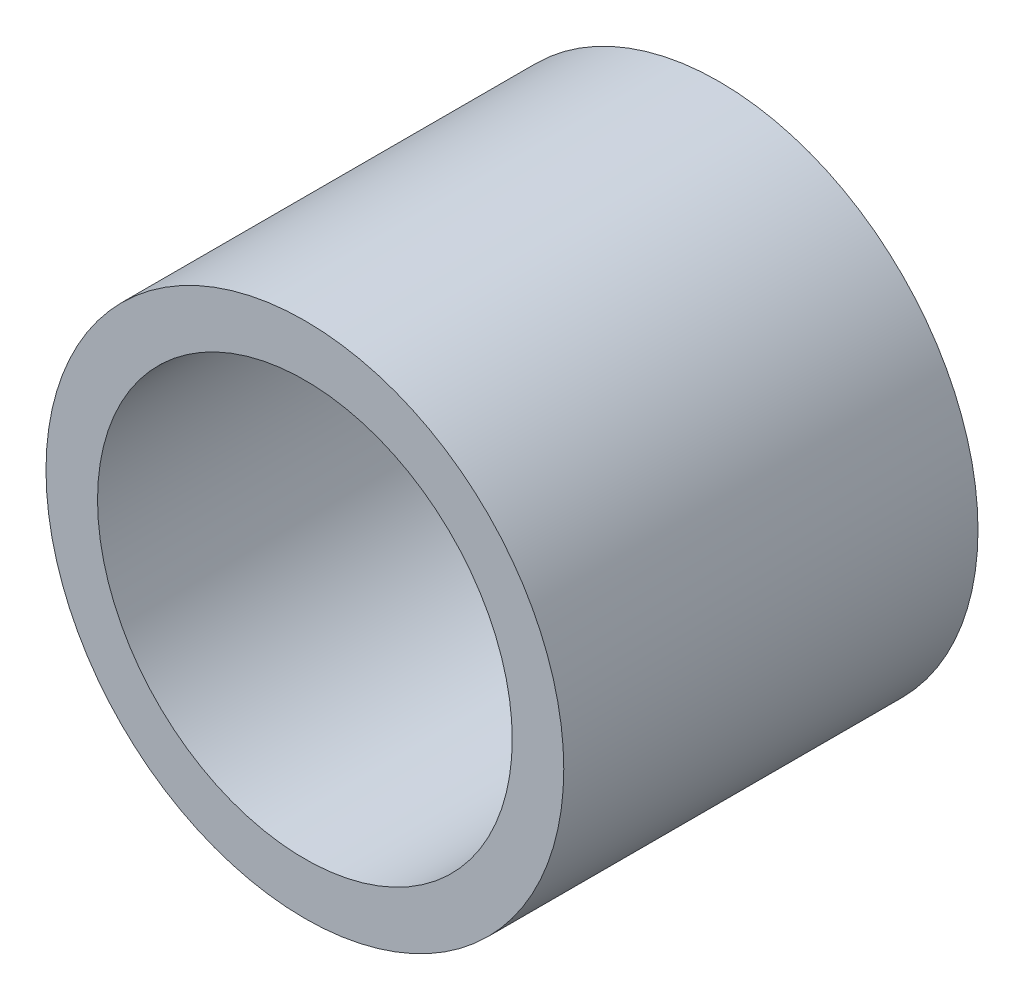
ISO-10303-21;
HEADER;
FILE_DESCRIPTION(('STEP AP214'),'2;1');
FILE_NAME('part.step','',(''),(''),'','','');
FILE_SCHEMA(('AUTOMOTIVE_DESIGN { 1 0 10303 214 1 1 1 1 }'));
ENDSEC;
DATA;
#1=APPLICATION_CONTEXT('core data for automotive mechanical design processes');
#2=APPLICATION_PROTOCOL_DEFINITION('international standard','automotive_design',2000,#1);
#3=PRODUCT_CONTEXT('',#1,'mechanical');
#4=PRODUCT('Part','Part','',(#3));
#5=PRODUCT_RELATED_PRODUCT_CATEGORY('part','',(#4));
#6=PRODUCT_DEFINITION_FORMATION('','',#4);
#7=PRODUCT_DEFINITION_CONTEXT('part definition',#1,'design');
#8=PRODUCT_DEFINITION('design','',#6,#7);
#9=PRODUCT_DEFINITION_SHAPE('','',#8);
#10=(LENGTH_UNIT() NAMED_UNIT(*) SI_UNIT(.MILLI.,.METRE.));
#11=(NAMED_UNIT(*) PLANE_ANGLE_UNIT() SI_UNIT($,.RADIAN.));
#12=(NAMED_UNIT(*) SI_UNIT($,.STERADIAN.) SOLID_ANGLE_UNIT());
#13=UNCERTAINTY_MEASURE_WITH_UNIT(LENGTH_MEASURE(1.E-05),#10,'distance_accuracy_value','');
#14=(GEOMETRIC_REPRESENTATION_CONTEXT(3) GLOBAL_UNCERTAINTY_ASSIGNED_CONTEXT((#13)) GLOBAL_UNIT_ASSIGNED_CONTEXT((#10,
#11,#12)) REPRESENTATION_CONTEXT('',''));
#15=CARTESIAN_POINT('',(0.,0.,0.));
#16=DIRECTION('',(0.,0.,1.));
#17=DIRECTION('',(1.,0.,0.));
#18=AXIS2_PLACEMENT_3D('',#15,#16,#17);
#19=CARTESIAN_POINT('',(0.,0.,-3.175));
#20=DIRECTION('',(0.,0.,1.));
#21=DIRECTION('',(1.,0.,0.));
#22=AXIS2_PLACEMENT_3D('',#19,#20,#21);
#23=CYLINDRICAL_SURFACE('',#22,3.96875);
#24=CARTESIAN_POINT('',(0.,0.,-3.175));
#25=DIRECTION('',(0.,0.,1.));
#26=DIRECTION('',(1.,0.,0.));
#27=AXIS2_PLACEMENT_3D('',#24,#25,#26);
#28=CIRCLE('',#27,3.96875);
#29=CARTESIAN_POINT('',(3.96875,0.,-3.175));
#30=VERTEX_POINT('',#29);
#31=EDGE_CURVE('E10',#30,#30,#28,.T.);
#32=ORIENTED_EDGE('',*,*,#31,.T.);
#33=EDGE_LOOP('',(#32));
#34=FACE_BOUND('',#33,.T.);
#35=CARTESIAN_POINT('',(0.,0.,3.175));
#36=DIRECTION('',(0.,0.,1.));
#37=DIRECTION('',(1.,0.,0.));
#38=AXIS2_PLACEMENT_3D('',#35,#36,#37);
#39=CIRCLE('',#38,3.96875);
#40=CARTESIAN_POINT('',(3.96875,0.,3.175));
#41=VERTEX_POINT('',#40);
#42=EDGE_CURVE('E45',#41,#41,#39,.T.);
#43=ORIENTED_EDGE('',*,*,#42,.F.);
#44=EDGE_LOOP('',(#43));
#45=FACE_BOUND('',#44,.T.);
#46=ADVANCED_FACE('F35',(#34,#45),#23,.T.);
#47=CARTESIAN_POINT('',(0.,0.,-3.175));
#48=DIRECTION('',(0.,0.,1.));
#49=DIRECTION('',(1.,0.,0.));
#50=AXIS2_PLACEMENT_3D('',#47,#48,#49);
#51=PLANE('',#50);
#52=CARTESIAN_POINT('',(0.,0.,-3.175));
#53=DIRECTION('',(0.,0.,1.));
#54=DIRECTION('',(1.,0.,0.));
#55=AXIS2_PLACEMENT_3D('',#52,#53,#54);
#56=CIRCLE('',#55,3.17881);
#57=CARTESIAN_POINT('',(3.17881,0.,-3.175));
#58=VERTEX_POINT('',#57);
#59=EDGE_CURVE('E41',#58,#58,#56,.T.);
#60=ORIENTED_EDGE('',*,*,#59,.T.);
#61=EDGE_LOOP('',(#60));
#62=FACE_BOUND('',#61,.T.);
#63=ORIENTED_EDGE('',*,*,#31,.F.);
#64=EDGE_LOOP('',(#63));
#65=FACE_BOUND('',#64,.T.);
#66=ADVANCED_FACE('F64',(#62,#65),#51,.F.);
#67=CARTESIAN_POINT('',(0.,0.,-3.175));
#68=DIRECTION('',(0.,0.,1.));
#69=DIRECTION('',(1.,0.,0.));
#70=AXIS2_PLACEMENT_3D('',#67,#68,#69);
#71=CYLINDRICAL_SURFACE('',#70,3.17881);
#72=ORIENTED_EDGE('',*,*,#59,.F.);
#73=EDGE_LOOP('',(#72));
#74=FACE_BOUND('',#73,.T.);
#75=CARTESIAN_POINT('',(0.,0.,3.175));
#76=DIRECTION('',(0.,0.,1.));
#77=DIRECTION('',(1.,0.,0.));
#78=AXIS2_PLACEMENT_3D('',#75,#76,#77);
#79=CIRCLE('',#78,3.17881);
#80=CARTESIAN_POINT('',(3.17881,0.,3.175));
#81=VERTEX_POINT('',#80);
#82=EDGE_CURVE('E49',#81,#81,#79,.T.);
#83=ORIENTED_EDGE('',*,*,#82,.T.);
#84=EDGE_LOOP('',(#83));
#85=FACE_BOUND('',#84,.T.);
#86=ADVANCED_FACE('F55',(#74,#85),#71,.F.);
#87=CARTESIAN_POINT('',(0.,0.,3.175));
#88=DIRECTION('',(0.,0.,1.));
#89=DIRECTION('',(1.,0.,0.));
#90=AXIS2_PLACEMENT_3D('',#87,#88,#89);
#91=PLANE('',#90);
#92=ORIENTED_EDGE('',*,*,#42,.T.);
#93=EDGE_LOOP('',(#92));
#94=FACE_BOUND('',#93,.T.);
#95=ORIENTED_EDGE('',*,*,#82,.F.);
#96=EDGE_LOOP('',(#95));
#97=FACE_BOUND('',#96,.T.);
#98=ADVANCED_FACE('F57',(#94,#97),#91,.T.);
#99=CLOSED_SHELL('',(#46,#66,#86,#98));
#100=MANIFOLD_SOLID_BREP('B2',#99);
#101=ADVANCED_BREP_SHAPE_REPRESENTATION('',(#18,#100),#14);
#102=SHAPE_DEFINITION_REPRESENTATION(#9,#101);
ENDSEC;
END-ISO-10303-21;
